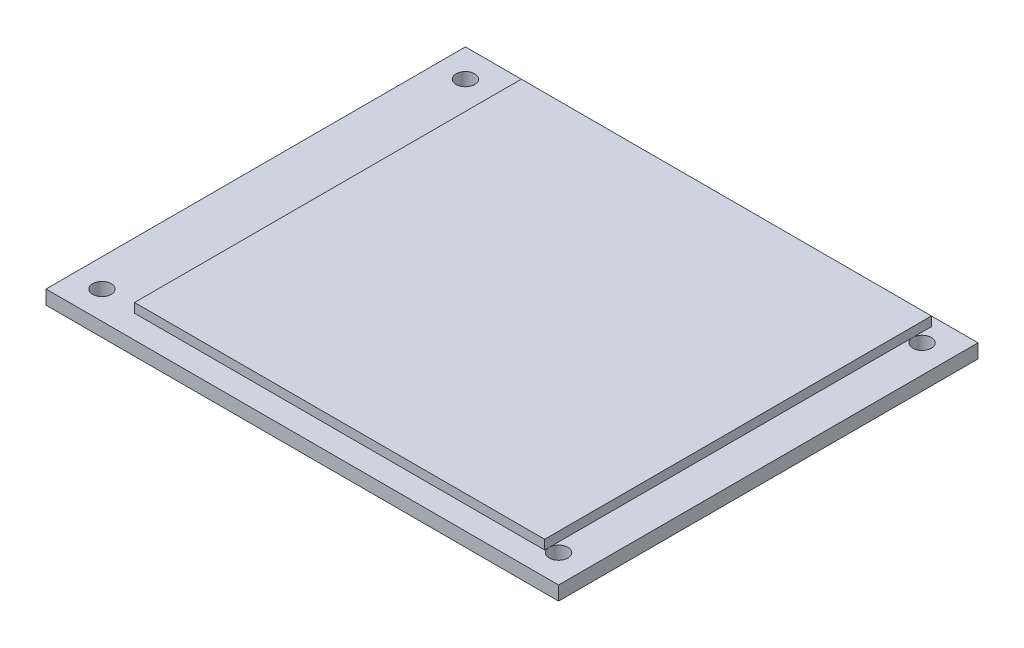
ISO-10303-21;
HEADER;
FILE_DESCRIPTION(('STEP AP214'),'2;1');
FILE_NAME('part.step','',(''),(''),'','','');
FILE_SCHEMA(('AUTOMOTIVE_DESIGN { 1 0 10303 214 1 1 1 1 }'));
ENDSEC;
DATA;
#1=APPLICATION_CONTEXT('core data for automotive mechanical design processes');
#2=APPLICATION_PROTOCOL_DEFINITION('international standard','automotive_design',2000,#1);
#3=PRODUCT_CONTEXT('',#1,'mechanical');
#4=PRODUCT('Part','Part','',(#3));
#5=PRODUCT_RELATED_PRODUCT_CATEGORY('part','',(#4));
#6=PRODUCT_DEFINITION_FORMATION('','',#4);
#7=PRODUCT_DEFINITION_CONTEXT('part definition',#1,'design');
#8=PRODUCT_DEFINITION('design','',#6,#7);
#9=PRODUCT_DEFINITION_SHAPE('','',#8);
#10=(LENGTH_UNIT() NAMED_UNIT(*) SI_UNIT(.MILLI.,.METRE.));
#11=(NAMED_UNIT(*) PLANE_ANGLE_UNIT() SI_UNIT($,.RADIAN.));
#12=(NAMED_UNIT(*) SI_UNIT($,.STERADIAN.) SOLID_ANGLE_UNIT());
#13=UNCERTAINTY_MEASURE_WITH_UNIT(LENGTH_MEASURE(1.E-05),#10,'distance_accuracy_value','');
#14=(GEOMETRIC_REPRESENTATION_CONTEXT(3) GLOBAL_UNCERTAINTY_ASSIGNED_CONTEXT((#13)) GLOBAL_UNIT_ASSIGNED_CONTEXT((#10,
#11,#12)) REPRESENTATION_CONTEXT('',''));
#15=CARTESIAN_POINT('',(0.,0.,0.));
#16=DIRECTION('',(0.,0.,1.));
#17=DIRECTION('',(1.,0.,0.));
#18=AXIS2_PLACEMENT_3D('',#15,#16,#17);
#19=CARTESIAN_POINT('',(-33.1988745927811,7.34894881770015,72.9869749490172));
#20=DIRECTION('',(0.,-1.,0.));
#21=DIRECTION('',(0.,0.,-1.));
#22=AXIS2_PLACEMENT_3D('',#19,#20,#21);
#23=PLANE('',#22);
#24=CARTESIAN_POINT('',(-30.1988745927811,7.34894881770015,69.9869749490172));
#25=DIRECTION('',(0.,1.,0.));
#26=DIRECTION('',(0.,0.,1.));
#27=AXIS2_PLACEMENT_3D('',#24,#25,#26);
#28=CIRCLE('',#27,0.999999999999999);
#29=CARTESIAN_POINT('',(-30.1988745927811,7.34894881770015,70.9869749490172));
#30=VERTEX_POINT('',#29);
#31=EDGE_CURVE('E307',#30,#30,#28,.T.);
#32=ORIENTED_EDGE('',*,*,#31,.F.);
#33=EDGE_LOOP('',(#32));
#34=FACE_BOUND('',#33,.T.);
#35=CARTESIAN_POINT('',(-30.1988745927811,7.34894881770015,30.9869749490172));
#36=DIRECTION('',(0.,1.,0.));
#37=DIRECTION('',(0.,0.,1.));
#38=AXIS2_PLACEMENT_3D('',#35,#36,#37);
#39=CIRCLE('',#38,1.);
#40=CARTESIAN_POINT('',(-30.1988745927811,7.34894881770015,31.9869749490172));
#41=VERTEX_POINT('',#40);
#42=EDGE_CURVE('E310',#41,#41,#39,.T.);
#43=ORIENTED_EDGE('',*,*,#42,.F.);
#44=EDGE_LOOP('',(#43));
#45=FACE_BOUND('',#44,.T.);
#46=DIRECTION('',(0.,0.,1.));
#47=VECTOR('',#46,1.);
#48=CARTESIAN_POINT('',(-33.1988745927811,7.34894881770015,72.9869749490172));
#49=LINE('',#48,#47);
#50=CARTESIAN_POINT('',(-33.1988745927811,7.34894881770015,27.9869749490172));
#51=VERTEX_POINT('',#50);
#52=CARTESIAN_POINT('',(-33.1988745927811,7.34894881770015,72.9869749490172));
#53=VERTEX_POINT('',#52);
#54=EDGE_CURVE('E119',#51,#53,#49,.T.);
#55=ORIENTED_EDGE('',*,*,#54,.T.);
#56=DIRECTION('',(1.,0.,0.));
#57=VECTOR('',#56,1.);
#58=CARTESIAN_POINT('',(-33.1988745927811,7.34894881770015,72.9869749490172));
#59=LINE('',#58,#57);
#60=CARTESIAN_POINT('',(21.8011254072189,7.34894881770015,72.9869749490172));
#61=VERTEX_POINT('',#60);
#62=EDGE_CURVE('E122',#53,#61,#59,.T.);
#63=ORIENTED_EDGE('',*,*,#62,.T.);
#64=DIRECTION('',(0.,0.,-1.));
#65=VECTOR('',#64,1.);
#66=CARTESIAN_POINT('',(21.8011254072189,7.34894881770015,72.9869749490172));
#67=LINE('',#66,#65);
#68=CARTESIAN_POINT('',(21.8011254072189,7.34894881770015,27.9869749490172));
#69=VERTEX_POINT('',#68);
#70=EDGE_CURVE('E125',#61,#69,#67,.T.);
#71=ORIENTED_EDGE('',*,*,#70,.T.);
#72=DIRECTION('',(-1.,0.,0.));
#73=VECTOR('',#72,1.);
#74=CARTESIAN_POINT('',(-33.1988745927811,7.34894881770015,27.9869749490172));
#75=LINE('',#74,#73);
#76=EDGE_CURVE('E127',#69,#51,#75,.T.);
#77=ORIENTED_EDGE('',*,*,#76,.T.);
#78=EDGE_LOOP('',(#55,#63,#71,#77));
#79=FACE_BOUND('',#78,.T.);
#80=DIRECTION('',(0.,0.,-1.));
#81=VECTOR('',#80,1.);
#82=CARTESIAN_POINT('',(17.8011254072189,7.34894881770015,28.9869749490172));
#83=LINE('',#82,#81);
#84=CARTESIAN_POINT('',(17.8011254072189,7.34894881770015,30.9869749490172));
#85=VERTEX_POINT('',#84);
#86=CARTESIAN_POINT('',(17.8011254072189,7.34894881770015,28.9869749490172));
#87=VERTEX_POINT('',#86);
#88=EDGE_CURVE('E329',#85,#87,#83,.T.);
#89=ORIENTED_EDGE('',*,*,#88,.F.);
#90=CARTESIAN_POINT('',(18.8011254072189,7.34894881770015,30.9869749490172));
#91=DIRECTION('',(0.,1.,0.));
#92=DIRECTION('',(0.,0.,1.));
#93=AXIS2_PLACEMENT_3D('',#90,#91,#92);
#94=CIRCLE('',#93,0.999999999999998);
#95=EDGE_CURVE('E29',#85,#85,#94,.T.);
#96=ORIENTED_EDGE('',*,*,#95,.F.);
#97=CARTESIAN_POINT('',(17.8011254072189,7.34894881770015,69.9869749490171));
#98=VERTEX_POINT('',#97);
#99=EDGE_CURVE('E333',#98,#85,#83,.T.);
#100=ORIENTED_EDGE('',*,*,#99,.F.);
#101=CARTESIAN_POINT('',(18.8011254072189,7.34894881770015,69.9869749490172));
#102=DIRECTION('',(0.,1.,0.));
#103=DIRECTION('',(0.,0.,1.));
#104=AXIS2_PLACEMENT_3D('',#101,#102,#103);
#105=CIRCLE('',#104,0.999999999999998);
#106=EDGE_CURVE('E34',#98,#98,#105,.T.);
#107=ORIENTED_EDGE('',*,*,#106,.F.);
#108=CARTESIAN_POINT('',(17.8011254072189,7.34894881770015,70.4869749490172));
#109=VERTEX_POINT('',#108);
#110=EDGE_CURVE('E330',#109,#98,#83,.T.);
#111=ORIENTED_EDGE('',*,*,#110,.F.);
#112=DIRECTION('',(1.,0.,0.));
#113=VECTOR('',#112,1.);
#114=CARTESIAN_POINT('',(-26.1988745927811,7.34894881770015,70.4869749490172));
#115=LINE('',#114,#113);
#116=CARTESIAN_POINT('',(-26.1988745927811,7.34894881770015,70.4869749490172));
#117=VERTEX_POINT('',#116);
#118=EDGE_CURVE('E327',#117,#109,#115,.T.);
#119=ORIENTED_EDGE('',*,*,#118,.F.);
#120=DIRECTION('',(0.,0.,1.));
#121=VECTOR('',#120,1.);
#122=CARTESIAN_POINT('',(-26.1988745927811,7.34894881770015,28.9869749490172));
#123=LINE('',#122,#121);
#124=CARTESIAN_POINT('',(-26.1988745927811,7.34894881770015,28.9869749490172));
#125=VERTEX_POINT('',#124);
#126=EDGE_CURVE('E109',#125,#117,#123,.T.);
#127=ORIENTED_EDGE('',*,*,#126,.F.);
#128=DIRECTION('',(-1.,0.,0.));
#129=VECTOR('',#128,1.);
#130=CARTESIAN_POINT('',(-26.1988745927811,7.34894881770015,28.9869749490172));
#131=LINE('',#130,#129);
#132=EDGE_CURVE('E106',#87,#125,#131,.T.);
#133=ORIENTED_EDGE('',*,*,#132,.F.);
#134=EDGE_LOOP('',(#89,#96,#100,#107,#111,#119,#127,#133));
#135=FACE_BOUND('',#134,.T.);
#136=ADVANCED_FACE('F16',(#34,#45,#79,#135),#23,.F.);
#137=CARTESIAN_POINT('',(-33.1988745927811,7.34894881770015,72.9869749490172));
#138=DIRECTION('',(1.,0.,0.));
#139=DIRECTION('',(0.,0.,-1.));
#140=AXIS2_PLACEMENT_3D('',#137,#138,#139);
#141=PLANE('',#140);
#142=DIRECTION('',(0.,0.,1.));
#143=VECTOR('',#142,1.);
#144=CARTESIAN_POINT('',(-33.1988745927811,5.84894881770015,72.9869749490172));
#145=LINE('',#144,#143);
#146=CARTESIAN_POINT('',(-33.1988745927811,5.84894881770015,27.9869749490172));
#147=VERTEX_POINT('',#146);
#148=CARTESIAN_POINT('',(-33.1988745927811,5.84894881770015,72.9869749490172));
#149=VERTEX_POINT('',#148);
#150=EDGE_CURVE('E110',#147,#149,#145,.T.);
#151=ORIENTED_EDGE('',*,*,#150,.T.);
#152=DIRECTION('',(0.,-1.,0.));
#153=VECTOR('',#152,1.);
#154=CARTESIAN_POINT('',(-33.1988745927811,7.34894881770015,72.9869749490172));
#155=LINE('',#154,#153);
#156=EDGE_CURVE('E11',#53,#149,#155,.T.);
#157=ORIENTED_EDGE('',*,*,#156,.F.);
#158=ORIENTED_EDGE('',*,*,#54,.F.);
#159=DIRECTION('',(0.,-1.,0.));
#160=VECTOR('',#159,1.);
#161=CARTESIAN_POINT('',(-33.1988745927811,7.34894881770015,27.9869749490172));
#162=LINE('',#161,#160);
#163=EDGE_CURVE('E128',#51,#147,#162,.T.);
#164=ORIENTED_EDGE('',*,*,#163,.T.);
#165=EDGE_LOOP('',(#151,#157,#158,#164));
#166=FACE_BOUND('',#165,.T.);
#167=ADVANCED_FACE('F18',(#166),#141,.F.);
#168=CARTESIAN_POINT('',(-33.1988745927811,7.34894881770015,72.9869749490172));
#169=DIRECTION('',(0.,0.,-1.));
#170=DIRECTION('',(-1.,0.,0.));
#171=AXIS2_PLACEMENT_3D('',#168,#169,#170);
#172=PLANE('',#171);
#173=DIRECTION('',(1.,0.,0.));
#174=VECTOR('',#173,1.);
#175=CARTESIAN_POINT('',(-33.1988745927811,5.84894881770015,72.9869749490172));
#176=LINE('',#175,#174);
#177=CARTESIAN_POINT('',(21.8011254072189,5.84894881770015,72.9869749490172));
#178=VERTEX_POINT('',#177);
#179=EDGE_CURVE('E113',#149,#178,#176,.T.);
#180=ORIENTED_EDGE('',*,*,#179,.T.);
#181=DIRECTION('',(0.,-1.,0.));
#182=VECTOR('',#181,1.);
#183=CARTESIAN_POINT('',(21.8011254072189,7.34894881770015,72.9869749490172));
#184=LINE('',#183,#182);
#185=EDGE_CURVE('E24',#61,#178,#184,.T.);
#186=ORIENTED_EDGE('',*,*,#185,.F.);
#187=ORIENTED_EDGE('',*,*,#62,.F.);
#188=ORIENTED_EDGE('',*,*,#156,.T.);
#189=EDGE_LOOP('',(#180,#186,#187,#188));
#190=FACE_BOUND('',#189,.T.);
#191=ADVANCED_FACE('F159',(#190),#172,.F.);
#192=CARTESIAN_POINT('',(21.8011254072189,7.34894881770015,72.9869749490172));
#193=DIRECTION('',(-1.,0.,0.));
#194=DIRECTION('',(0.,0.,1.));
#195=AXIS2_PLACEMENT_3D('',#192,#193,#194);
#196=PLANE('',#195);
#197=DIRECTION('',(0.,0.,-1.));
#198=VECTOR('',#197,1.);
#199=CARTESIAN_POINT('',(21.8011254072189,5.84894881770015,72.9869749490172));
#200=LINE('',#199,#198);
#201=CARTESIAN_POINT('',(21.8011254072189,5.84894881770015,27.9869749490172));
#202=VERTEX_POINT('',#201);
#203=EDGE_CURVE('E131',#178,#202,#200,.T.);
#204=ORIENTED_EDGE('',*,*,#203,.T.);
#205=DIRECTION('',(0.,-1.,0.));
#206=VECTOR('',#205,1.);
#207=CARTESIAN_POINT('',(21.8011254072189,7.34894881770015,27.9869749490172));
#208=LINE('',#207,#206);
#209=EDGE_CURVE('E136',#69,#202,#208,.T.);
#210=ORIENTED_EDGE('',*,*,#209,.F.);
#211=ORIENTED_EDGE('',*,*,#70,.F.);
#212=ORIENTED_EDGE('',*,*,#185,.T.);
#213=EDGE_LOOP('',(#204,#210,#211,#212));
#214=FACE_BOUND('',#213,.T.);
#215=ADVANCED_FACE('F143',(#214),#196,.F.);
#216=CARTESIAN_POINT('',(-33.1988745927811,7.34894881770015,27.9869749490172));
#217=DIRECTION('',(0.,0.,1.));
#218=DIRECTION('',(1.,0.,0.));
#219=AXIS2_PLACEMENT_3D('',#216,#217,#218);
#220=PLANE('',#219);
#221=DIRECTION('',(-1.,0.,0.));
#222=VECTOR('',#221,1.);
#223=CARTESIAN_POINT('',(-33.1988745927811,5.84894881770015,27.9869749490172));
#224=LINE('',#223,#222);
#225=EDGE_CURVE('E123',#202,#147,#224,.T.);
#226=ORIENTED_EDGE('',*,*,#225,.T.);
#227=ORIENTED_EDGE('',*,*,#163,.F.);
#228=ORIENTED_EDGE('',*,*,#76,.F.);
#229=ORIENTED_EDGE('',*,*,#209,.T.);
#230=EDGE_LOOP('',(#226,#227,#228,#229));
#231=FACE_BOUND('',#230,.T.);
#232=ADVANCED_FACE('F152',(#231),#220,.F.);
#233=CARTESIAN_POINT('',(-33.1988745927811,5.84894881770015,72.9869749490172));
#234=DIRECTION('',(0.,-1.,0.));
#235=DIRECTION('',(0.,0.,-1.));
#236=AXIS2_PLACEMENT_3D('',#233,#234,#235);
#237=PLANE('',#236);
#238=CARTESIAN_POINT('',(-30.1988745927811,5.84894881770015,69.9869749490172));
#239=DIRECTION('',(0.,1.,0.));
#240=DIRECTION('',(0.,0.,1.));
#241=AXIS2_PLACEMENT_3D('',#238,#239,#240);
#242=CIRCLE('',#241,0.999999999999999);
#243=CARTESIAN_POINT('',(-30.1988745927811,5.84894881770015,70.9869749490172));
#244=VERTEX_POINT('',#243);
#245=EDGE_CURVE('E305',#244,#244,#242,.T.);
#246=ORIENTED_EDGE('',*,*,#245,.T.);
#247=EDGE_LOOP('',(#246));
#248=FACE_BOUND('',#247,.T.);
#249=CARTESIAN_POINT('',(18.8011254072189,5.84894881770015,30.9869749490172));
#250=DIRECTION('',(0.,1.,0.));
#251=DIRECTION('',(0.,0.,1.));
#252=AXIS2_PLACEMENT_3D('',#249,#250,#251);
#253=CIRCLE('',#252,0.999999999999998);
#254=CARTESIAN_POINT('',(18.8011254072189,5.84894881770015,31.9869749490172));
#255=VERTEX_POINT('',#254);
#256=EDGE_CURVE('E308',#255,#255,#253,.T.);
#257=ORIENTED_EDGE('',*,*,#256,.T.);
#258=EDGE_LOOP('',(#257));
#259=FACE_BOUND('',#258,.T.);
#260=CARTESIAN_POINT('',(18.8011254072189,5.84894881770015,69.9869749490172));
#261=DIRECTION('',(0.,1.,0.));
#262=DIRECTION('',(0.,0.,1.));
#263=AXIS2_PLACEMENT_3D('',#260,#261,#262);
#264=CIRCLE('',#263,0.999999999999998);
#265=CARTESIAN_POINT('',(18.8011254072189,5.84894881770015,70.9869749490172));
#266=VERTEX_POINT('',#265);
#267=EDGE_CURVE('E317',#266,#266,#264,.T.);
#268=ORIENTED_EDGE('',*,*,#267,.T.);
#269=EDGE_LOOP('',(#268));
#270=FACE_BOUND('',#269,.T.);
#271=CARTESIAN_POINT('',(-30.1988745927811,5.84894881770015,30.9869749490172));
#272=DIRECTION('',(0.,1.,0.));
#273=DIRECTION('',(0.,0.,1.));
#274=AXIS2_PLACEMENT_3D('',#271,#272,#273);
#275=CIRCLE('',#274,1.);
#276=CARTESIAN_POINT('',(-30.1988745927811,5.84894881770015,31.9869749490172));
#277=VERTEX_POINT('',#276);
#278=EDGE_CURVE('E318',#277,#277,#275,.T.);
#279=ORIENTED_EDGE('',*,*,#278,.T.);
#280=EDGE_LOOP('',(#279));
#281=FACE_BOUND('',#280,.T.);
#282=ORIENTED_EDGE('',*,*,#150,.F.);
#283=ORIENTED_EDGE('',*,*,#225,.F.);
#284=ORIENTED_EDGE('',*,*,#203,.F.);
#285=ORIENTED_EDGE('',*,*,#179,.F.);
#286=EDGE_LOOP('',(#282,#283,#284,#285));
#287=FACE_BOUND('',#286,.T.);
#288=ADVANCED_FACE('F149',(#248,#259,#270,#281,#287),#237,.T.);
#289=CARTESIAN_POINT('',(-26.1988745927811,8.34894881770015,28.9869749490172));
#290=DIRECTION('',(1.,0.,0.));
#291=DIRECTION('',(0.,0.,-1.));
#292=AXIS2_PLACEMENT_3D('',#289,#290,#291);
#293=PLANE('',#292);
#294=ORIENTED_EDGE('',*,*,#126,.T.);
#295=DIRECTION('',(0.,-1.,0.));
#296=VECTOR('',#295,1.);
#297=CARTESIAN_POINT('',(-26.1988745927811,8.34894881770015,70.4869749490172));
#298=LINE('',#297,#296);
#299=CARTESIAN_POINT('',(-26.1988745927811,8.34894881770015,70.4869749490172));
#300=VERTEX_POINT('',#299);
#301=EDGE_CURVE('E90',#300,#117,#298,.T.);
#302=ORIENTED_EDGE('',*,*,#301,.F.);
#303=DIRECTION('',(0.,0.,1.));
#304=VECTOR('',#303,1.);
#305=CARTESIAN_POINT('',(-26.1988745927811,8.34894881770015,28.9869749490172));
#306=LINE('',#305,#304);
#307=CARTESIAN_POINT('',(-26.1988745927811,8.34894881770015,28.9869749490172));
#308=VERTEX_POINT('',#307);
#309=EDGE_CURVE('E97',#308,#300,#306,.T.);
#310=ORIENTED_EDGE('',*,*,#309,.F.);
#311=DIRECTION('',(0.,-1.,0.));
#312=VECTOR('',#311,1.);
#313=CARTESIAN_POINT('',(-26.1988745927811,8.34894881770015,28.9869749490172));
#314=LINE('',#313,#312);
#315=EDGE_CURVE('E325',#308,#125,#314,.T.);
#316=ORIENTED_EDGE('',*,*,#315,.T.);
#317=EDGE_LOOP('',(#294,#302,#310,#316));
#318=FACE_BOUND('',#317,.T.);
#319=ADVANCED_FACE('F108',(#318),#293,.F.);
#320=CARTESIAN_POINT('',(-26.1988745927811,8.34894881770015,70.4869749490172));
#321=DIRECTION('',(0.,0.,-1.));
#322=DIRECTION('',(-1.,0.,0.));
#323=AXIS2_PLACEMENT_3D('',#320,#321,#322);
#324=PLANE('',#323);
#325=ORIENTED_EDGE('',*,*,#118,.T.);
#326=DIRECTION('',(0.,-1.,0.));
#327=VECTOR('',#326,1.);
#328=CARTESIAN_POINT('',(17.8011254072189,8.34894881770015,70.4869749490172));
#329=LINE('',#328,#327);
#330=CARTESIAN_POINT('',(17.8011254072189,8.34894881770015,70.4869749490172));
#331=VERTEX_POINT('',#330);
#332=EDGE_CURVE('E93',#331,#109,#329,.T.);
#333=ORIENTED_EDGE('',*,*,#332,.F.);
#334=DIRECTION('',(1.,0.,0.));
#335=VECTOR('',#334,1.);
#336=CARTESIAN_POINT('',(-26.1988745927811,8.34894881770015,70.4869749490172));
#337=LINE('',#336,#335);
#338=EDGE_CURVE('E85',#300,#331,#337,.T.);
#339=ORIENTED_EDGE('',*,*,#338,.F.);
#340=ORIENTED_EDGE('',*,*,#301,.T.);
#341=EDGE_LOOP('',(#325,#333,#339,#340));
#342=FACE_BOUND('',#341,.T.);
#343=ADVANCED_FACE('F88',(#342),#324,.F.);
#344=CARTESIAN_POINT('',(17.8011254072189,8.34894881770015,28.9869749490172));
#345=DIRECTION('',(-1.,0.,0.));
#346=DIRECTION('',(0.,0.,1.));
#347=AXIS2_PLACEMENT_3D('',#344,#345,#346);
#348=PLANE('',#347);
#349=ORIENTED_EDGE('',*,*,#110,.T.);
#350=ORIENTED_EDGE('',*,*,#99,.T.);
#351=ORIENTED_EDGE('',*,*,#88,.T.);
#352=DIRECTION('',(0.,-1.,0.));
#353=VECTOR('',#352,1.);
#354=CARTESIAN_POINT('',(17.8011254072189,8.34894881770015,28.9869749490172));
#355=LINE('',#354,#353);
#356=CARTESIAN_POINT('',(17.8011254072189,8.34894881770015,28.9869749490172));
#357=VERTEX_POINT('',#356);
#358=EDGE_CURVE('E115',#357,#87,#355,.T.);
#359=ORIENTED_EDGE('',*,*,#358,.F.);
#360=DIRECTION('',(0.,0.,-1.));
#361=VECTOR('',#360,1.);
#362=CARTESIAN_POINT('',(17.8011254072189,8.34894881770015,28.9869749490172));
#363=LINE('',#362,#361);
#364=EDGE_CURVE('E96',#331,#357,#363,.T.);
#365=ORIENTED_EDGE('',*,*,#364,.F.);
#366=ORIENTED_EDGE('',*,*,#332,.T.);
#367=EDGE_LOOP('',(#349,#350,#351,#359,#365,#366));
#368=FACE_BOUND('',#367,.T.);
#369=ADVANCED_FACE('F202',(#368),#348,.F.);
#370=CARTESIAN_POINT('',(-26.1988745927811,8.34894881770015,28.9869749490172));
#371=DIRECTION('',(0.,0.,1.));
#372=DIRECTION('',(1.,0.,0.));
#373=AXIS2_PLACEMENT_3D('',#370,#371,#372);
#374=PLANE('',#373);
#375=ORIENTED_EDGE('',*,*,#132,.T.);
#376=ORIENTED_EDGE('',*,*,#315,.F.);
#377=DIRECTION('',(-1.,0.,0.));
#378=VECTOR('',#377,1.);
#379=CARTESIAN_POINT('',(-26.1988745927811,8.34894881770015,28.9869749490172));
#380=LINE('',#379,#378);
#381=EDGE_CURVE('E102',#357,#308,#380,.T.);
#382=ORIENTED_EDGE('',*,*,#381,.F.);
#383=ORIENTED_EDGE('',*,*,#358,.T.);
#384=EDGE_LOOP('',(#375,#376,#382,#383));
#385=FACE_BOUND('',#384,.T.);
#386=ADVANCED_FACE('F208',(#385),#374,.F.);
#387=CARTESIAN_POINT('',(-33.1988745927811,8.34894881770015,72.9869749490172));
#388=DIRECTION('',(0.,1.,0.));
#389=DIRECTION('',(0.,0.,1.));
#390=AXIS2_PLACEMENT_3D('',#387,#388,#389);
#391=PLANE('',#390);
#392=ORIENTED_EDGE('',*,*,#309,.T.);
#393=ORIENTED_EDGE('',*,*,#338,.T.);
#394=ORIENTED_EDGE('',*,*,#364,.T.);
#395=ORIENTED_EDGE('',*,*,#381,.T.);
#396=EDGE_LOOP('',(#392,#393,#394,#395));
#397=FACE_BOUND('',#396,.T.);
#398=ADVANCED_FACE('F100',(#397),#391,.T.);
#399=CARTESIAN_POINT('',(-30.1988745927811,5.84894881770015,30.9869749490172));
#400=DIRECTION('',(0.,1.,0.));
#401=DIRECTION('',(0.,0.,1.));
#402=AXIS2_PLACEMENT_3D('',#399,#400,#401);
#403=CYLINDRICAL_SURFACE('',#402,1.);
#404=ORIENTED_EDGE('',*,*,#278,.F.);
#405=EDGE_LOOP('',(#404));
#406=FACE_BOUND('',#405,.T.);
#407=ORIENTED_EDGE('',*,*,#42,.T.);
#408=EDGE_LOOP('',(#407));
#409=FACE_BOUND('',#408,.T.);
#410=ADVANCED_FACE('F223',(#406,#409),#403,.F.);
#411=CARTESIAN_POINT('',(18.8011254072189,5.84894881770015,69.9869749490172));
#412=DIRECTION('',(0.,1.,0.));
#413=DIRECTION('',(0.,0.,1.));
#414=AXIS2_PLACEMENT_3D('',#411,#412,#413);
#415=CYLINDRICAL_SURFACE('',#414,0.999999999999998);
#416=ORIENTED_EDGE('',*,*,#267,.F.);
#417=EDGE_LOOP('',(#416));
#418=FACE_BOUND('',#417,.T.);
#419=ORIENTED_EDGE('',*,*,#106,.T.);
#420=EDGE_LOOP('',(#419));
#421=FACE_BOUND('',#420,.T.);
#422=ADVANCED_FACE('F230',(#418,#421),#415,.F.);
#423=CARTESIAN_POINT('',(18.8011254072189,5.84894881770015,30.9869749490172));
#424=DIRECTION('',(0.,1.,0.));
#425=DIRECTION('',(0.,0.,1.));
#426=AXIS2_PLACEMENT_3D('',#423,#424,#425);
#427=CYLINDRICAL_SURFACE('',#426,0.999999999999998);
#428=ORIENTED_EDGE('',*,*,#256,.F.);
#429=EDGE_LOOP('',(#428));
#430=FACE_BOUND('',#429,.T.);
#431=ORIENTED_EDGE('',*,*,#95,.T.);
#432=EDGE_LOOP('',(#431));
#433=FACE_BOUND('',#432,.T.);
#434=ADVANCED_FACE('F238',(#430,#433),#427,.F.);
#435=CARTESIAN_POINT('',(-30.1988745927811,5.84894881770015,69.9869749490172));
#436=DIRECTION('',(0.,1.,0.));
#437=DIRECTION('',(0.,0.,1.));
#438=AXIS2_PLACEMENT_3D('',#435,#436,#437);
#439=CYLINDRICAL_SURFACE('',#438,0.999999999999999);
#440=ORIENTED_EDGE('',*,*,#245,.F.);
#441=EDGE_LOOP('',(#440));
#442=FACE_BOUND('',#441,.T.);
#443=ORIENTED_EDGE('',*,*,#31,.T.);
#444=EDGE_LOOP('',(#443));
#445=FACE_BOUND('',#444,.T.);
#446=ADVANCED_FACE('F246',(#442,#445),#439,.F.);
#447=CLOSED_SHELL('',(#136,#167,#191,#215,#232,#288,#319,#343,#369,#386,#398,#410,#422,#434,#446));
#448=MANIFOLD_SOLID_BREP('B1',#447);
#449=ADVANCED_BREP_SHAPE_REPRESENTATION('',(#18,#448),#14);
#450=SHAPE_DEFINITION_REPRESENTATION(#9,#449);
ENDSEC;
END-ISO-10303-21;
